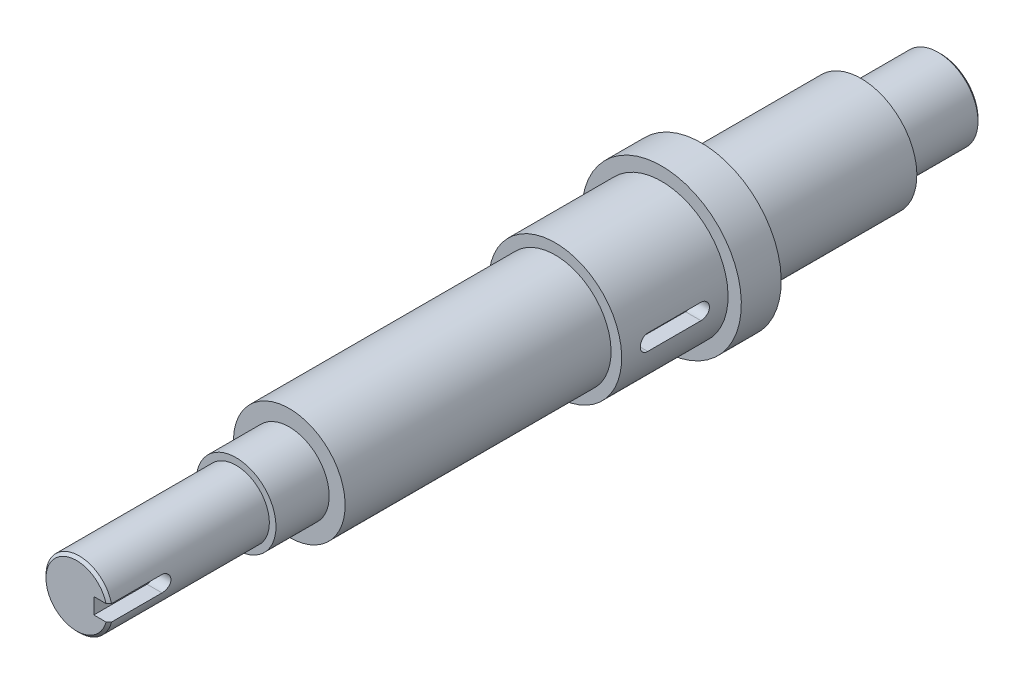
ISO-10303-21;
HEADER;
FILE_DESCRIPTION(('STEP AP214'),'2;1');
FILE_NAME('part.step','',(''),(''),'','','');
FILE_SCHEMA(('AUTOMOTIVE_DESIGN { 1 0 10303 214 1 1 1 1 }'));
ENDSEC;
DATA;
#1=APPLICATION_CONTEXT('core data for automotive mechanical design processes');
#2=APPLICATION_PROTOCOL_DEFINITION('international standard','automotive_design',2000,#1);
#3=PRODUCT_CONTEXT('',#1,'mechanical');
#4=PRODUCT('Part','Part','',(#3));
#5=PRODUCT_RELATED_PRODUCT_CATEGORY('part','',(#4));
#6=PRODUCT_DEFINITION_FORMATION('','',#4);
#7=PRODUCT_DEFINITION_CONTEXT('part definition',#1,'design');
#8=PRODUCT_DEFINITION('design','',#6,#7);
#9=PRODUCT_DEFINITION_SHAPE('','',#8);
#10=(LENGTH_UNIT() NAMED_UNIT(*) SI_UNIT(.MILLI.,.METRE.));
#11=(NAMED_UNIT(*) PLANE_ANGLE_UNIT() SI_UNIT($,.RADIAN.));
#12=(NAMED_UNIT(*) SI_UNIT($,.STERADIAN.) SOLID_ANGLE_UNIT());
#13=UNCERTAINTY_MEASURE_WITH_UNIT(LENGTH_MEASURE(1.E-05),#10,'distance_accuracy_value','');
#14=(GEOMETRIC_REPRESENTATION_CONTEXT(3) GLOBAL_UNCERTAINTY_ASSIGNED_CONTEXT((#13)) GLOBAL_UNIT_ASSIGNED_CONTEXT((#10,
#11,#12)) REPRESENTATION_CONTEXT('',''));
#15=CARTESIAN_POINT('',(0.,0.,0.));
#16=DIRECTION('',(0.,0.,1.));
#17=DIRECTION('',(1.,0.,0.));
#18=AXIS2_PLACEMENT_3D('',#15,#16,#17);
#19=CARTESIAN_POINT('',(0.,12.5,225.));
#20=DIRECTION('',(0.,0.,-1.));
#21=DIRECTION('',(0.,1.,0.));
#22=AXIS2_PLACEMENT_3D('',#19,#20,#21);
#23=PLANE('',#22);
#24=DIRECTION('',(1.,0.,0.));
#25=VECTOR('',#24,1.);
#26=CARTESIAN_POINT('',(6.5,3.,225.));
#27=LINE('',#26,#25);
#28=CARTESIAN_POINT('',(6.5,3.,225.));
#29=VERTEX_POINT('',#28);
#30=CARTESIAN_POINT('',(11.1018016555872,3.,225.));
#31=VERTEX_POINT('',#30);
#32=EDGE_CURVE('E168',#29,#31,#27,.T.);
#33=ORIENTED_EDGE('',*,*,#32,.T.);
#34=CARTESIAN_POINT('',(0.,0.,225.));
#35=DIRECTION('',(0.,0.,-1.));
#36=DIRECTION('',(0.,1.,0.));
#37=AXIS2_PLACEMENT_3D('',#34,#35,#36);
#38=CIRCLE('',#37,11.4999999999999);
#39=CARTESIAN_POINT('',(11.1018016555872,-3.,225.));
#40=VERTEX_POINT('',#39);
#41=EDGE_CURVE('E314',#31,#40,#38,.F.);
#42=ORIENTED_EDGE('',*,*,#41,.T.);
#43=DIRECTION('',(1.,0.,0.));
#44=VECTOR('',#43,1.);
#45=CARTESIAN_POINT('',(6.5,-3.,225.));
#46=LINE('',#45,#44);
#47=CARTESIAN_POINT('',(6.5,-3.,225.));
#48=VERTEX_POINT('',#47);
#49=EDGE_CURVE('E166',#48,#40,#46,.T.);
#50=ORIENTED_EDGE('',*,*,#49,.F.);
#51=DIRECTION('',(0.,-1.,0.));
#52=VECTOR('',#51,1.);
#53=CARTESIAN_POINT('',(6.5,3.,225.));
#54=LINE('',#53,#52);
#55=EDGE_CURVE('E156',#29,#48,#54,.T.);
#56=ORIENTED_EDGE('',*,*,#55,.F.);
#57=EDGE_LOOP('',(#33,#42,#50,#56));
#58=FACE_BOUND('',#57,.T.);
#59=ADVANCED_FACE('F41',(#58),#23,.F.);
#60=CARTESIAN_POINT('',(0.,0.,225.));
#61=DIRECTION('',(0.,0.,1.));
#62=DIRECTION('',(0.,-1.,0.));
#63=AXIS2_PLACEMENT_3D('',#60,#61,#62);
#64=CYLINDRICAL_SURFACE('',#63,12.5);
#65=DIRECTION('',(0.,0.,1.));
#66=VECTOR('',#65,1.);
#67=CARTESIAN_POINT('',(12.1346610995116,-3.,225.));
#68=LINE('',#67,#66);
#69=CARTESIAN_POINT('',(12.1346610995116,-3.,205.));
#70=VERTEX_POINT('',#69);
#71=CARTESIAN_POINT('',(12.1346610995116,-3.,224.));
#72=VERTEX_POINT('',#71);
#73=EDGE_CURVE('E220',#70,#72,#68,.T.);
#74=ORIENTED_EDGE('',*,*,#73,.T.);
#75=CARTESIAN_POINT('',(0.,0.,224.));
#76=DIRECTION('',(0.,0.,-1.));
#77=DIRECTION('',(0.,1.,0.));
#78=AXIS2_PLACEMENT_3D('',#75,#76,#77);
#79=CIRCLE('',#78,12.5);
#80=CARTESIAN_POINT('',(12.1346610995116,3.,224.));
#81=VERTEX_POINT('',#80);
#82=EDGE_CURVE('E56',#72,#81,#79,.T.);
#83=ORIENTED_EDGE('',*,*,#82,.T.);
#84=DIRECTION('',(0.,0.,1.));
#85=VECTOR('',#84,1.);
#86=CARTESIAN_POINT('',(12.1346610995116,3.,225.));
#87=LINE('',#86,#85);
#88=CARTESIAN_POINT('',(12.1346610995116,3.,205.));
#89=VERTEX_POINT('',#88);
#90=EDGE_CURVE('E565',#81,#89,#87,.F.);
#91=ORIENTED_EDGE('',*,*,#90,.T.);
#92=CARTESIAN_POINT('',(12.1346610995116,3.,205.));
#93=CARTESIAN_POINT('',(12.1346522494377,3.00000949206979,204.916922978224));
#94=CARTESIAN_POINT('',(12.1355140524429,2.9965492402964,204.833851503937));
#95=CARTESIAN_POINT('',(12.1389133501175,2.9827629517344,204.668327529238));
#96=CARTESIAN_POINT('',(12.1414505792905,2.97243800275821,204.585874932847));
#97=CARTESIAN_POINT('',(12.1481288815223,2.94502172728164,204.422323492026));
#98=CARTESIAN_POINT('',(12.1522669359733,2.92794313450063,204.341222397578));
#99=CARTESIAN_POINT('',(12.1620165769448,2.88717657683583,204.180811857538));
#100=CARTESIAN_POINT('',(12.1676281805746,2.86348853521017,204.101502432762));
#101=CARTESIAN_POINT('',(12.1864398460761,2.7827647601969,203.86709852316));
#102=CARTESIAN_POINT('',(12.2016236292527,2.71604288181318,203.715371740793));
#103=CARTESIAN_POINT('',(12.2355556800476,2.5588284327867,203.425304451274));
#104=CARTESIAN_POINT('',(12.2543047763988,2.46833033365202,203.286967067702));
#105=CARTESIAN_POINT('',(12.2936784117551,2.26416625581385,203.024742779937));
#106=CARTESIAN_POINT('',(12.3143307958798,2.15010988819482,202.901163433566));
#107=CARTESIAN_POINT('',(12.3549430601195,1.90290471965317,202.67469002816));
#108=CARTESIAN_POINT('',(12.3749028300057,1.76975289686003,202.571799249307));
#109=CARTESIAN_POINT('',(12.4121880567312,1.48603085597283,202.388371734287));
#110=CARTESIAN_POINT('',(12.4294765791586,1.33525974307935,202.308137550489));
#111=CARTESIAN_POINT('',(12.4591517430967,1.02189537698329,202.174270606708));
#112=CARTESIAN_POINT('',(12.4715392966163,0.859304329995022,202.120632896982));
#113=CARTESIAN_POINT('',(12.4898199872169,0.530138997790636,202.042462317637));
#114=CARTESIAN_POINT('',(12.4958303689195,0.363696274008473,202.017403356202));
#115=CARTESIAN_POINT('',(12.5010873641785,0.0288643563729922,201.995452403577));
#116=CARTESIAN_POINT('',(12.5003347508813,-0.139524612787223,201.998557192704));
#117=CARTESIAN_POINT('',(12.4922383469812,-0.469819905954051,202.032463772677));
#118=CARTESIAN_POINT('',(12.4850297856931,-0.631788371671667,202.062697336209));
#119=CARTESIAN_POINT('',(12.464987849248,-0.948281253446577,202.149092233943));
#120=CARTESIAN_POINT('',(12.4521542369652,-1.10280535537953,202.205254661189));
#121=CARTESIAN_POINT('',(12.4220935759201,-1.40155039959009,202.342387659867));
#122=CARTESIAN_POINT('',(12.4048300917434,-1.54567254355723,202.423565148096));
#123=CARTESIAN_POINT('',(12.3677898661535,-1.81844702027331,202.608266219249));
#124=CARTESIAN_POINT('',(12.3480127820245,-1.94709723884516,202.711792850704));
#125=CARTESIAN_POINT('',(12.307525839261,-2.18865245335658,202.941301220019));
#126=CARTESIAN_POINT('',(12.2868050152656,-2.30108617171468,203.067777478397));
#127=CARTESIAN_POINT('',(12.2472145750706,-2.5032746352754,203.338044279781));
#128=CARTESIAN_POINT('',(12.2283454653372,-2.59302318632836,203.481839535922));
#129=CARTESIAN_POINT('',(12.1945549652828,-2.74756993908988,203.783555221143));
#130=CARTESIAN_POINT('',(12.1796525676294,-2.81224875674972,203.941538928879));
#131=CARTESIAN_POINT('',(12.1557369076828,-2.91390343638912,204.266484145526));
#132=CARTESIAN_POINT('',(12.1467148610395,-2.95092063280088,204.43343185786));
#133=CARTESIAN_POINT('',(12.139016121434,-2.98233825509737,204.668168527332));
#134=CARTESIAN_POINT('',(12.1373853406504,-2.98896283223369,204.734406938336));
#135=CARTESIAN_POINT('',(12.1352084107543,-2.9977885892548,204.867086518971));
#136=CARTESIAN_POINT('',(12.1346604885734,-2.99999700022266,204.933527178444));
#137=CARTESIAN_POINT('',(12.1346610995116,-3.,205.));
#138=B_SPLINE_CURVE_WITH_KNOTS('',3,(#92,#93,#94,#95,#96,#97,#98,#99,#100,#101,#102,#103,#104,
#105,#106,#107,#108,#109,#110,#111,#112,#113,#114,#115,#116,#117,#118,#119,#120,#121,#122,#123,
#124,#125,#126,#127,#128,#129,#130,#131,#132,#133,#134,#135,#136,#137),.UNSPECIFIED.,.F.,.F.,(4,
2,2,2,2,2,2,2,2,2,2,2,2,2,2,2,2,2,2,2,2,2,4),(0.,0.24914497147599,0.498250471667307,
0.746888516046017,0.99552944746449,1.49234020490804,1.98926658412719,2.49520478005361,
3.00122312962131,3.51370966397379,4.02610078608322,4.52889907799787,5.03163989067205,
5.52409016416463,6.01656119905144,6.51322041190944,7.00994741434777,7.51903074401432,
8.02825292829705,8.5398711192154,9.05072326792552,9.25036600195107,9.44968157003441),.UNSPECIFIED.);
#139=EDGE_CURVE('E211',#89,#70,#138,.T.);
#140=ORIENTED_EDGE('',*,*,#139,.T.);
#141=EDGE_LOOP('',(#74,#83,#91,#140));
#142=FACE_BOUND('',#141,.T.);
#143=CARTESIAN_POINT('',(0.,0.,165.));
#144=DIRECTION('',(0.,0.,1.));
#145=DIRECTION('',(0.,-1.,0.));
#146=AXIS2_PLACEMENT_3D('',#143,#144,#145);
#147=CIRCLE('',#146,12.5);
#148=CARTESIAN_POINT('',(0.,-12.5,165.));
#149=VERTEX_POINT('',#148);
#150=EDGE_CURVE('E208',#149,#149,#147,.T.);
#151=ORIENTED_EDGE('',*,*,#150,.T.);
#152=EDGE_LOOP('',(#151));
#153=FACE_BOUND('',#152,.T.);
#154=ADVANCED_FACE('F222',(#142,#153),#64,.T.);
#155=CARTESIAN_POINT('',(0.,12.5,165.));
#156=DIRECTION('',(0.,0.,-1.));
#157=DIRECTION('',(0.,1.,0.));
#158=AXIS2_PLACEMENT_3D('',#155,#156,#157);
#159=PLANE('',#158);
#160=ORIENTED_EDGE('',*,*,#150,.F.);
#161=EDGE_LOOP('',(#160));
#162=FACE_BOUND('',#161,.T.);
#163=CARTESIAN_POINT('',(0.,0.,165.));
#164=DIRECTION('',(0.,0.,1.));
#165=DIRECTION('',(0.,-1.,0.));
#166=AXIS2_PLACEMENT_3D('',#163,#164,#165);
#167=CIRCLE('',#166,15.);
#168=CARTESIAN_POINT('',(0.,-15.,165.));
#169=VERTEX_POINT('',#168);
#170=EDGE_CURVE('E205',#169,#169,#167,.T.);
#171=ORIENTED_EDGE('',*,*,#170,.T.);
#172=EDGE_LOOP('',(#171));
#173=FACE_BOUND('',#172,.T.);
#174=ADVANCED_FACE('F353',(#162,#173),#159,.F.);
#175=CARTESIAN_POINT('',(0.,0.,225.));
#176=DIRECTION('',(0.,0.,1.));
#177=DIRECTION('',(0.,-1.,0.));
#178=AXIS2_PLACEMENT_3D('',#175,#176,#177);
#179=CYLINDRICAL_SURFACE('',#178,15.);
#180=ORIENTED_EDGE('',*,*,#170,.F.);
#181=EDGE_LOOP('',(#180));
#182=FACE_BOUND('',#181,.T.);
#183=CARTESIAN_POINT('',(0.,0.,145.));
#184=DIRECTION('',(0.,0.,1.));
#185=DIRECTION('',(0.,-1.,0.));
#186=AXIS2_PLACEMENT_3D('',#183,#184,#185);
#187=CIRCLE('',#186,15.);
#188=CARTESIAN_POINT('',(0.,-15.,145.));
#189=VERTEX_POINT('',#188);
#190=EDGE_CURVE('E202',#189,#189,#187,.T.);
#191=ORIENTED_EDGE('',*,*,#190,.T.);
#192=EDGE_LOOP('',(#191));
#193=FACE_BOUND('',#192,.T.);
#194=ADVANCED_FACE('F484',(#182,#193),#179,.T.);
#195=CARTESIAN_POINT('',(0.,15.,145.));
#196=DIRECTION('',(0.,0.,-1.));
#197=DIRECTION('',(0.,1.,0.));
#198=AXIS2_PLACEMENT_3D('',#195,#196,#197);
#199=PLANE('',#198);
#200=ORIENTED_EDGE('',*,*,#190,.F.);
#201=EDGE_LOOP('',(#200));
#202=FACE_BOUND('',#201,.T.);
#203=CARTESIAN_POINT('',(0.,0.,145.));
#204=DIRECTION('',(0.,0.,1.));
#205=DIRECTION('',(0.,-1.,0.));
#206=AXIS2_PLACEMENT_3D('',#203,#204,#205);
#207=CIRCLE('',#206,21.);
#208=CARTESIAN_POINT('',(0.,-21.,145.));
#209=VERTEX_POINT('',#208);
#210=EDGE_CURVE('E199',#209,#209,#207,.T.);
#211=ORIENTED_EDGE('',*,*,#210,.T.);
#212=EDGE_LOOP('',(#211));
#213=FACE_BOUND('',#212,.T.);
#214=ADVANCED_FACE('F475',(#202,#213),#199,.F.);
#215=CARTESIAN_POINT('',(0.,0.,225.));
#216=DIRECTION('',(0.,0.,1.));
#217=DIRECTION('',(0.,-1.,0.));
#218=AXIS2_PLACEMENT_3D('',#215,#216,#217);
#219=CYLINDRICAL_SURFACE('',#218,21.);
#220=ORIENTED_EDGE('',*,*,#210,.F.);
#221=EDGE_LOOP('',(#220));
#222=FACE_BOUND('',#221,.T.);
#223=CARTESIAN_POINT('',(0.,0.,45.));
#224=DIRECTION('',(0.,0.,1.));
#225=DIRECTION('',(0.,-1.,0.));
#226=AXIS2_PLACEMENT_3D('',#223,#224,#225);
#227=CIRCLE('',#226,21.);
#228=CARTESIAN_POINT('',(0.,-21.,45.));
#229=VERTEX_POINT('',#228);
#230=EDGE_CURVE('E196',#229,#229,#227,.T.);
#231=ORIENTED_EDGE('',*,*,#230,.T.);
#232=EDGE_LOOP('',(#231));
#233=FACE_BOUND('',#232,.T.);
#234=ADVANCED_FACE('F466',(#222,#233),#219,.T.);
#235=CARTESIAN_POINT('',(0.,21.,45.));
#236=DIRECTION('',(0.,0.,-1.));
#237=DIRECTION('',(0.,1.,0.));
#238=AXIS2_PLACEMENT_3D('',#235,#236,#237);
#239=PLANE('',#238);
#240=ORIENTED_EDGE('',*,*,#230,.F.);
#241=EDGE_LOOP('',(#240));
#242=FACE_BOUND('',#241,.T.);
#243=CARTESIAN_POINT('',(0.,0.,45.));
#244=DIRECTION('',(0.,0.,1.));
#245=DIRECTION('',(0.,-1.,0.));
#246=AXIS2_PLACEMENT_3D('',#243,#244,#245);
#247=CIRCLE('',#246,25.);
#248=CARTESIAN_POINT('',(0.,-25.,45.));
#249=VERTEX_POINT('',#248);
#250=EDGE_CURVE('E193',#249,#249,#247,.T.);
#251=ORIENTED_EDGE('',*,*,#250,.T.);
#252=EDGE_LOOP('',(#251));
#253=FACE_BOUND('',#252,.T.);
#254=ADVANCED_FACE('F276',(#242,#253),#239,.F.);
#255=CARTESIAN_POINT('',(0.,0.,225.));
#256=DIRECTION('',(0.,0.,1.));
#257=DIRECTION('',(0.,-1.,0.));
#258=AXIS2_PLACEMENT_3D('',#255,#256,#257);
#259=CYLINDRICAL_SURFACE('',#258,25.);
#260=DIRECTION('',(0.,0.,1.));
#261=VECTOR('',#260,1.);
#262=CARTESIAN_POINT('',(24.8193472919817,3.,225.));
#263=LINE('',#262,#261);
#264=CARTESIAN_POINT('',(24.8193472919817,3.,35.));
#265=VERTEX_POINT('',#264);
#266=CARTESIAN_POINT('',(24.8193472919817,3.,15.));
#267=VERTEX_POINT('',#266);
#268=EDGE_CURVE('E361',#265,#267,#263,.F.);
#269=ORIENTED_EDGE('',*,*,#268,.T.);
#270=CARTESIAN_POINT('',(24.8193472919817,3.,15.));
#271=CARTESIAN_POINT('',(24.8193430736193,3.00000843700235,14.9159454294658));
#272=CARTESIAN_POINT('',(24.8197741982077,2.99646747025333,14.8318951068114));
#273=CARTESIAN_POINT('',(24.8214759555701,2.98235207723993,14.6644017857417));
#274=CARTESIAN_POINT('',(24.8227465256294,2.97177817640363,14.5809587424276));
#275=CARTESIAN_POINT('',(24.8260943334576,2.94367627524767,14.4153487561558));
#276=CARTESIAN_POINT('',(24.8281707648871,2.92615522582029,14.3331806227325));
#277=CARTESIAN_POINT('',(24.833067059444,2.88430583660214,14.1706435046024));
#278=CARTESIAN_POINT('',(24.8358869177826,2.85997754065988,14.0902745083102));
#279=CARTESIAN_POINT('',(24.8453506394644,2.77699495332482,13.8526614373121));
#280=CARTESIAN_POINT('',(24.8530006371154,2.70832727734934,13.6988194165884));
#281=CARTESIAN_POINT('',(24.8701147720304,2.54636529375022,13.4049406113502));
#282=CARTESIAN_POINT('',(24.8795787509723,2.45307313505292,13.2649026236508));
#283=CARTESIAN_POINT('',(24.8993093935248,2.24397860633709,13.0017737438303));
#284=CARTESIAN_POINT('',(24.9095794895088,2.12807646891959,12.8787622524539));
#285=CARTESIAN_POINT('',(24.929735159082,1.87725939084289,12.6538800661769));
#286=CARTESIAN_POINT('',(24.9396206738931,1.74234155834833,12.552012592616));
#287=CARTESIAN_POINT('',(24.9579276686417,1.45682542703621,12.372031257657));
#288=CARTESIAN_POINT('',(24.9663446368759,1.30618100217361,12.2939900637665));
#289=CARTESIAN_POINT('',(24.9807274830984,0.993816096927466,12.1643483312082));
#290=CARTESIAN_POINT('',(24.9866935907597,0.832096656054214,12.1127453148765));
#291=CARTESIAN_POINT('',(24.995478678279,0.502989868574012,12.0376782357157));
#292=CARTESIAN_POINT('',(24.9983126679218,0.335633549841866,12.0140799277622));
#293=CARTESIAN_POINT('',(25.0005654502745,-0.000690387403205051,11.9952762772877));
#294=CARTESIAN_POINT('',(24.9999842845517,-0.169657986279601,12.0000705891887));
#295=CARTESIAN_POINT('',(24.9954842865412,-0.503486116101075,12.0378091713517));
#296=CARTESIAN_POINT('',(24.9915826671991,-0.668363323052681,12.070608270074));
#297=CARTESIAN_POINT('',(24.9808996061534,-0.990255211381979,12.1631984833145));
#298=CARTESIAN_POINT('',(24.9741181287549,-1.14726979527835,12.2229899323936));
#299=CARTESIAN_POINT('',(24.9584076216555,-1.44943435784417,12.3680242361996));
#300=CARTESIAN_POINT('',(24.9494732343632,-1.59455350752095,12.4533307157787));
#301=CARTESIAN_POINT('',(24.930457665413,-1.86846446131942,12.646923724757));
#302=CARTESIAN_POINT('',(24.9203764842939,-1.99725627311207,12.7552102433596));
#303=CARTESIAN_POINT('',(24.9001221731951,-2.23569948521557,12.9924860710071));
#304=CARTESIAN_POINT('',(24.8899488597477,-2.34522783687393,13.1215990400248));
#305=CARTESIAN_POINT('',(24.8707153122042,-2.54111038184353,13.3964907357138));
#306=CARTESIAN_POINT('',(24.8616554109923,-2.62745765364829,13.5422744215129));
#307=CARTESIAN_POINT('',(24.8456732661311,-2.77453048342125,13.8464951727214));
#308=CARTESIAN_POINT('',(24.8387530810146,-2.83523138851723,14.0049442397206));
#309=CARTESIAN_POINT('',(24.8278671834514,-2.92904058504843,14.3297723502964));
#310=CARTESIAN_POINT('',(24.8238970186796,-2.96219046692828,14.4961390386934));
#311=CARTESIAN_POINT('',(24.8208658563087,-2.98741264811551,14.7197465098321));
#312=CARTESIAN_POINT('',(24.8202967895628,-2.9921351676027,14.7757413064748));
#313=CARTESIAN_POINT('',(24.8195379557837,-2.9984246127832,14.8878161899351));
#314=CARTESIAN_POINT('',(24.8193475536301,-2.99999682241004,14.9438959757855));
#315=CARTESIAN_POINT('',(24.8193472919817,-3.,15.));
#316=B_SPLINE_CURVE_WITH_KNOTS('',3,(#270,#271,#272,#273,#274,#275,#276,#277,#278,#279,#280,
#281,#282,#283,#284,#285,#286,#287,#288,#289,#290,#291,#292,#293,#294,#295,#296,#297,#298,#299,
#300,#301,#302,#303,#304,#305,#306,#307,#308,#309,#310,#311,#312,#313,#314,#315),.UNSPECIFIED.,
.F.,.F.,(4,2,2,2,2,2,2,2,2,2,2,2,2,2,2,2,2,2,2,2,2,2,4),(0.,0.252080487248508,0.504142143765639,
0.755952236629468,1.00776070750916,1.51110152671864,2.01439843495776,2.51996855511054,
3.02561564359015,3.53278983870558,4.03991649509849,4.5446022091959,5.04928178057386,
5.55136096184882,6.05344636639431,6.55679437122678,7.0601421395737,7.56659676194983,
8.07320243596132,8.58029398875541,9.08661864921346,9.25514284244892,9.42338413699563),.UNSPECIFIED.);
#317=CARTESIAN_POINT('',(24.8193472919817,-3.,15.));
#318=VERTEX_POINT('',#317);
#319=EDGE_CURVE('E281',#267,#318,#316,.T.);
#320=ORIENTED_EDGE('',*,*,#319,.T.);
#321=DIRECTION('',(0.,0.,1.));
#322=VECTOR('',#321,1.);
#323=CARTESIAN_POINT('',(24.8193472919817,-3.,225.));
#324=LINE('',#323,#322);
#325=CARTESIAN_POINT('',(24.8193472919817,-2.99999999999998,35.));
#326=VERTEX_POINT('',#325);
#327=EDGE_CURVE('E294',#318,#326,#324,.T.);
#328=ORIENTED_EDGE('',*,*,#327,.T.);
#329=CARTESIAN_POINT('',(24.8193472919817,-3.,35.));
#330=CARTESIAN_POINT('',(24.8193430736193,-3.00000843700235,35.0840545705342));
#331=CARTESIAN_POINT('',(24.8197741982077,-2.99646747025333,35.1681048931886));
#332=CARTESIAN_POINT('',(24.8214759555701,-2.98235207723993,35.3355982142582));
#333=CARTESIAN_POINT('',(24.8227465256294,-2.97177817640363,35.4190412575723));
#334=CARTESIAN_POINT('',(24.8260943334576,-2.94367627524767,35.5846512438442));
#335=CARTESIAN_POINT('',(24.8281707648871,-2.92615522582029,35.6668193772675));
#336=CARTESIAN_POINT('',(24.833067059444,-2.88430583660214,35.8293564953975));
#337=CARTESIAN_POINT('',(24.8358869177826,-2.85997754065988,35.9097254916897));
#338=CARTESIAN_POINT('',(24.8453506394644,-2.77699495332482,36.1473385626879));
#339=CARTESIAN_POINT('',(24.8530006371154,-2.70832727734934,36.3011805834115));
#340=CARTESIAN_POINT('',(24.8701147720304,-2.54636529375022,36.5950593886498));
#341=CARTESIAN_POINT('',(24.8795787509723,-2.45307313505291,36.7350973763491));
#342=CARTESIAN_POINT('',(24.8993093935248,-2.24397860633708,36.9982262561697));
#343=CARTESIAN_POINT('',(24.9095794895088,-2.12807646891959,37.121237747546));
#344=CARTESIAN_POINT('',(24.929735159082,-1.87725939084289,37.3461199338231));
#345=CARTESIAN_POINT('',(24.9396206738931,-1.74234155834833,37.447987407384));
#346=CARTESIAN_POINT('',(24.9579276686417,-1.45682542703621,37.6279687423429));
#347=CARTESIAN_POINT('',(24.9663446368759,-1.30618100217361,37.7060099362334));
#348=CARTESIAN_POINT('',(24.9807274830984,-0.993816096927468,37.8356516687917));
#349=CARTESIAN_POINT('',(24.9866935907597,-0.832096656054216,37.8872546851235));
#350=CARTESIAN_POINT('',(24.995478678279,-0.502989868574014,37.9623217642842));
#351=CARTESIAN_POINT('',(24.9983126679218,-0.335633549841867,37.9859200722377));
#352=CARTESIAN_POINT('',(25.0005654502745,0.000690387403203262,38.0047237227123));
#353=CARTESIAN_POINT('',(24.9999842845517,0.169657986279599,37.9999294108113));
#354=CARTESIAN_POINT('',(24.9954842865412,0.503486116101073,37.9621908286482));
#355=CARTESIAN_POINT('',(24.9915826671991,0.66836332305268,37.929391729926));
#356=CARTESIAN_POINT('',(24.9808996061534,0.990255211381977,37.8368015166855));
#357=CARTESIAN_POINT('',(24.9741181287549,1.14726979527835,37.7770100676064));
#358=CARTESIAN_POINT('',(24.9584076216555,1.44943435784417,37.6319757638004));
#359=CARTESIAN_POINT('',(24.9494732343632,1.59455350752095,37.5466692842213));
#360=CARTESIAN_POINT('',(24.930457665413,1.86846446131942,37.353076275243));
#361=CARTESIAN_POINT('',(24.9203764842939,1.99725627311207,37.2447897566403));
#362=CARTESIAN_POINT('',(24.9001221731951,2.23569948521557,37.0075139289929));
#363=CARTESIAN_POINT('',(24.8899488597477,2.34522783687393,36.8784009599752));
#364=CARTESIAN_POINT('',(24.8707153122042,2.54111038184353,36.6035092642862));
#365=CARTESIAN_POINT('',(24.8616554109923,2.62745765364829,36.457725578487));
#366=CARTESIAN_POINT('',(24.8456732661311,2.77453048342125,36.1535048272786));
#367=CARTESIAN_POINT('',(24.8387530810146,2.83523138851723,35.9950557602794));
#368=CARTESIAN_POINT('',(24.8278671834514,2.92904058504843,35.6702276497036));
#369=CARTESIAN_POINT('',(24.8238970186796,2.96219046692828,35.5038609613065));
#370=CARTESIAN_POINT('',(24.8208658563087,2.98741264811551,35.2802534901679));
#371=CARTESIAN_POINT('',(24.8202967895628,2.9921351676027,35.2242586935252));
#372=CARTESIAN_POINT('',(24.8195379557837,2.9984246127832,35.1121838100649));
#373=CARTESIAN_POINT('',(24.8193475536301,2.99999682241004,35.0561040242145));
#374=CARTESIAN_POINT('',(24.8193472919817,3.,35.));
#375=B_SPLINE_CURVE_WITH_KNOTS('',3,(#329,#330,#331,#332,#333,#334,#335,#336,#337,#338,#339,
#340,#341,#342,#343,#344,#345,#346,#347,#348,#349,#350,#351,#352,#353,#354,#355,#356,#357,#358,
#359,#360,#361,#362,#363,#364,#365,#366,#367,#368,#369,#370,#371,#372,#373,#374),.UNSPECIFIED.,
.F.,.F.,(4,2,2,2,2,2,2,2,2,2,2,2,2,2,2,2,2,2,2,2,2,2,4),(0.,0.252080487248506,0.504142143765639,
0.755952236629464,1.00776070750916,1.51110152671864,2.01439843495776,2.51996855511055,
3.02561564359015,3.53278983870558,4.03991649509848,4.54460220919589,5.04928178057386,
5.55136096184882,6.05344636639431,6.55679437122678,7.0601421395737,7.56659676194982,
8.07320243596131,8.5802939887554,9.08661864921347,9.25514284244891,9.42338413699563),.UNSPECIFIED.);
#376=EDGE_CURVE('E123',#326,#265,#375,.T.);
#377=ORIENTED_EDGE('',*,*,#376,.T.);
#378=EDGE_LOOP('',(#269,#320,#328,#377));
#379=FACE_BOUND('',#378,.T.);
#380=ORIENTED_EDGE('',*,*,#250,.F.);
#381=EDGE_LOOP('',(#380));
#382=FACE_BOUND('',#381,.T.);
#383=CARTESIAN_POINT('',(0.,0.,4.99999999999998));
#384=DIRECTION('',(0.,0.,1.));
#385=DIRECTION('',(0.,-1.,0.));
#386=AXIS2_PLACEMENT_3D('',#383,#384,#385);
#387=CIRCLE('',#386,25.);
#388=CARTESIAN_POINT('',(0.,-25.,4.99999999999998));
#389=VERTEX_POINT('',#388);
#390=EDGE_CURVE('E190',#389,#389,#387,.T.);
#391=ORIENTED_EDGE('',*,*,#390,.T.);
#392=EDGE_LOOP('',(#391));
#393=FACE_BOUND('',#392,.T.);
#394=ADVANCED_FACE('F271',(#379,#382,#393),#259,.T.);
#395=CARTESIAN_POINT('',(0.,25.,4.99999999999999));
#396=DIRECTION('',(0.,0.,-1.));
#397=DIRECTION('',(0.,1.,0.));
#398=AXIS2_PLACEMENT_3D('',#395,#396,#397);
#399=PLANE('',#398);
#400=ORIENTED_EDGE('',*,*,#390,.F.);
#401=EDGE_LOOP('',(#400));
#402=FACE_BOUND('',#401,.T.);
#403=CARTESIAN_POINT('',(0.,0.,5.));
#404=DIRECTION('',(0.,0.,1.));
#405=DIRECTION('',(0.,-1.,0.));
#406=AXIS2_PLACEMENT_3D('',#403,#404,#405);
#407=CIRCLE('',#406,30.);
#408=CARTESIAN_POINT('',(0.,-30.,5.));
#409=VERTEX_POINT('',#408);
#410=EDGE_CURVE('E187',#409,#409,#407,.T.);
#411=ORIENTED_EDGE('',*,*,#410,.T.);
#412=EDGE_LOOP('',(#411));
#413=FACE_BOUND('',#412,.T.);
#414=ADVANCED_FACE('F267',(#402,#413),#399,.F.);
#415=CARTESIAN_POINT('',(0.,0.,225.));
#416=DIRECTION('',(0.,0.,1.));
#417=DIRECTION('',(0.,-1.,0.));
#418=AXIS2_PLACEMENT_3D('',#415,#416,#417);
#419=CYLINDRICAL_SURFACE('',#418,30.);
#420=ORIENTED_EDGE('',*,*,#410,.F.);
#421=EDGE_LOOP('',(#420));
#422=FACE_BOUND('',#421,.T.);
#423=CARTESIAN_POINT('',(0.,0.,-10.));
#424=DIRECTION('',(0.,0.,1.));
#425=DIRECTION('',(0.,-1.,0.));
#426=AXIS2_PLACEMENT_3D('',#423,#424,#425);
#427=CIRCLE('',#426,30.);
#428=CARTESIAN_POINT('',(0.,-30.,-10.));
#429=VERTEX_POINT('',#428);
#430=EDGE_CURVE('E184',#429,#429,#427,.T.);
#431=ORIENTED_EDGE('',*,*,#430,.T.);
#432=EDGE_LOOP('',(#431));
#433=FACE_BOUND('',#432,.T.);
#434=ADVANCED_FACE('F263',(#422,#433),#419,.T.);
#435=CARTESIAN_POINT('',(0.,30.,-10.));
#436=DIRECTION('',(0.,0.,1.));
#437=DIRECTION('',(0.,-1.,0.));
#438=AXIS2_PLACEMENT_3D('',#435,#436,#437);
#439=PLANE('',#438);
#440=ORIENTED_EDGE('',*,*,#430,.F.);
#441=EDGE_LOOP('',(#440));
#442=FACE_BOUND('',#441,.T.);
#443=CARTESIAN_POINT('',(0.,0.,-10.));
#444=DIRECTION('',(0.,0.,1.));
#445=DIRECTION('',(0.,-1.,0.));
#446=AXIS2_PLACEMENT_3D('',#443,#444,#445);
#447=CIRCLE('',#446,21.);
#448=CARTESIAN_POINT('',(0.,-21.,-10.));
#449=VERTEX_POINT('',#448);
#450=EDGE_CURVE('E181',#449,#449,#447,.T.);
#451=ORIENTED_EDGE('',*,*,#450,.T.);
#452=EDGE_LOOP('',(#451));
#453=FACE_BOUND('',#452,.T.);
#454=ADVANCED_FACE('F259',(#442,#453),#439,.F.);
#455=CARTESIAN_POINT('',(0.,0.,225.));
#456=DIRECTION('',(0.,0.,1.));
#457=DIRECTION('',(0.,-1.,0.));
#458=AXIS2_PLACEMENT_3D('',#455,#456,#457);
#459=CYLINDRICAL_SURFACE('',#458,21.);
#460=ORIENTED_EDGE('',*,*,#450,.F.);
#461=EDGE_LOOP('',(#460));
#462=FACE_BOUND('',#461,.T.);
#463=CARTESIAN_POINT('',(0.,0.,-70.));
#464=DIRECTION('',(0.,0.,1.));
#465=DIRECTION('',(0.,-1.,0.));
#466=AXIS2_PLACEMENT_3D('',#463,#464,#465);
#467=CIRCLE('',#466,21.);
#468=CARTESIAN_POINT('',(0.,-21.,-70.));
#469=VERTEX_POINT('',#468);
#470=EDGE_CURVE('E178',#469,#469,#467,.T.);
#471=ORIENTED_EDGE('',*,*,#470,.T.);
#472=EDGE_LOOP('',(#471));
#473=FACE_BOUND('',#472,.T.);
#474=ADVANCED_FACE('F255',(#462,#473),#459,.T.);
#475=CARTESIAN_POINT('',(0.,21.,-70.));
#476=DIRECTION('',(0.,0.,1.));
#477=DIRECTION('',(0.,-1.,0.));
#478=AXIS2_PLACEMENT_3D('',#475,#476,#477);
#479=PLANE('',#478);
#480=CARTESIAN_POINT('',(0.,0.,-70.));
#481=DIRECTION('',(0.,0.,1.));
#482=DIRECTION('',(0.,-1.,0.));
#483=AXIS2_PLACEMENT_3D('',#480,#481,#482);
#484=CIRCLE('',#483,16.);
#485=CARTESIAN_POINT('',(0.,-16.,-70.));
#486=VERTEX_POINT('',#485);
#487=EDGE_CURVE('E49',#486,#486,#484,.T.);
#488=ORIENTED_EDGE('',*,*,#487,.T.);
#489=EDGE_LOOP('',(#488));
#490=FACE_BOUND('',#489,.T.);
#491=ORIENTED_EDGE('',*,*,#470,.F.);
#492=EDGE_LOOP('',(#491));
#493=FACE_BOUND('',#492,.T.);
#494=ADVANCED_FACE('F251',(#490,#493),#479,.F.);
#495=CARTESIAN_POINT('',(0.,0.,225.));
#496=DIRECTION('',(0.,0.,1.));
#497=DIRECTION('',(0.,-1.,0.));
#498=AXIS2_PLACEMENT_3D('',#495,#496,#497);
#499=CYLINDRICAL_SURFACE('',#498,15.);
#500=CARTESIAN_POINT('',(0.,0.,-71.));
#501=DIRECTION('',(0.,0.,1.));
#502=DIRECTION('',(0.,-1.,0.));
#503=AXIS2_PLACEMENT_3D('',#500,#501,#502);
#504=CIRCLE('',#503,15.);
#505=CARTESIAN_POINT('',(0.,-15.,-71.));
#506=VERTEX_POINT('',#505);
#507=EDGE_CURVE('E11',#506,#506,#504,.F.);
#508=ORIENTED_EDGE('',*,*,#507,.T.);
#509=EDGE_LOOP('',(#508));
#510=FACE_BOUND('',#509,.T.);
#511=CARTESIAN_POINT('',(0.,0.,-99.));
#512=DIRECTION('',(0.,0.,1.));
#513=DIRECTION('',(0.,-1.,0.));
#514=AXIS2_PLACEMENT_3D('',#511,#512,#513);
#515=CIRCLE('',#514,15.);
#516=CARTESIAN_POINT('',(0.,-15.,-99.));
#517=VERTEX_POINT('',#516);
#518=EDGE_CURVE('E332',#517,#517,#515,.T.);
#519=ORIENTED_EDGE('',*,*,#518,.T.);
#520=EDGE_LOOP('',(#519));
#521=FACE_BOUND('',#520,.T.);
#522=ADVANCED_FACE('F247',(#510,#521),#499,.T.);
#523=CARTESIAN_POINT('',(0.,15.,-100.));
#524=DIRECTION('',(0.,0.,1.));
#525=DIRECTION('',(0.,-1.,0.));
#526=AXIS2_PLACEMENT_3D('',#523,#524,#525);
#527=PLANE('',#526);
#528=CARTESIAN_POINT('',(0.,0.,-100.));
#529=DIRECTION('',(0.,0.,1.));
#530=DIRECTION('',(0.,-1.,0.));
#531=AXIS2_PLACEMENT_3D('',#528,#529,#530);
#532=CIRCLE('',#531,14.);
#533=CARTESIAN_POINT('',(0.,-14.,-100.));
#534=VERTEX_POINT('',#533);
#535=EDGE_CURVE('E335',#534,#534,#532,.F.);
#536=ORIENTED_EDGE('',*,*,#535,.T.);
#537=EDGE_LOOP('',(#536));
#538=FACE_BOUND('',#537,.T.);
#539=CARTESIAN_POINT('',(0.,0.,-100.));
#540=DIRECTION('',(0.,0.,-1.));
#541=DIRECTION('',(0.,1.,0.));
#542=AXIS2_PLACEMENT_3D('',#539,#540,#541);
#543=CIRCLE('',#542,3.5);
#544=CARTESIAN_POINT('',(0.,3.5,-100.));
#545=VERTEX_POINT('',#544);
#546=EDGE_CURVE('E165',#545,#545,#543,.T.);
#547=ORIENTED_EDGE('',*,*,#546,.F.);
#548=EDGE_LOOP('',(#547));
#549=FACE_BOUND('',#548,.T.);
#550=ADVANCED_FACE('F243',(#538,#549),#527,.F.);
#551=CARTESIAN_POINT('',(0.,0.,-81.));
#552=DIRECTION('',(0.,0.,-1.));
#553=DIRECTION('',(0.,1.,0.));
#554=AXIS2_PLACEMENT_3D('',#551,#552,#553);
#555=CONICAL_SURFACE('',#554,3.5,1.02974425867665);
#556=CARTESIAN_POINT('',(0.,0.,-78.8969878334035));
#557=VERTEX_POINT('',#556);
#558=VERTEX_LOOP('',#557);
#559=FACE_BOUND('',#558,.T.);
#560=CARTESIAN_POINT('',(0.,0.,-81.));
#561=DIRECTION('',(0.,0.,-1.));
#562=DIRECTION('',(0.,1.,0.));
#563=AXIS2_PLACEMENT_3D('',#560,#561,#562);
#564=CIRCLE('',#563,3.5);
#565=CARTESIAN_POINT('',(0.,3.49999999999999,-81.));
#566=VERTEX_POINT('',#565);
#567=EDGE_CURVE('E175',#566,#566,#564,.T.);
#568=ORIENTED_EDGE('',*,*,#567,.T.);
#569=EDGE_LOOP('',(#568));
#570=FACE_BOUND('',#569,.T.);
#571=ADVANCED_FACE('F239',(#559,#570),#555,.F.);
#572=CARTESIAN_POINT('',(0.,0.,-100.));
#573=DIRECTION('',(0.,0.,-1.));
#574=DIRECTION('',(0.,1.,0.));
#575=AXIS2_PLACEMENT_3D('',#572,#573,#574);
#576=CYLINDRICAL_SURFACE('',#575,3.5);
#577=ORIENTED_EDGE('',*,*,#567,.F.);
#578=EDGE_LOOP('',(#577));
#579=FACE_BOUND('',#578,.T.);
#580=ORIENTED_EDGE('',*,*,#546,.T.);
#581=EDGE_LOOP('',(#580));
#582=FACE_BOUND('',#581,.T.);
#583=ADVANCED_FACE('F232',(#579,#582),#576,.F.);
#584=CARTESIAN_POINT('',(6.5,0.,205.));
#585=DIRECTION('',(1.,0.,0.));
#586=DIRECTION('',(0.,0.,-1.));
#587=AXIS2_PLACEMENT_3D('',#584,#585,#586);
#588=CYLINDRICAL_SURFACE('',#587,3.);
#589=DIRECTION('',(1.,0.,0.));
#590=VECTOR('',#589,1.);
#591=CARTESIAN_POINT('',(6.5,3.,205.));
#592=LINE('',#591,#590);
#593=CARTESIAN_POINT('',(6.5,3.,205.));
#594=VERTEX_POINT('',#593);
#595=EDGE_CURVE('E161',#594,#89,#592,.T.);
#596=ORIENTED_EDGE('',*,*,#595,.F.);
#597=CARTESIAN_POINT('',(6.5,0.,205.));
#598=DIRECTION('',(1.,0.,0.));
#599=DIRECTION('',(0.,0.,-1.));
#600=AXIS2_PLACEMENT_3D('',#597,#598,#599);
#601=CIRCLE('',#600,3.);
#602=CARTESIAN_POINT('',(6.5,-3.,205.));
#603=VERTEX_POINT('',#602);
#604=EDGE_CURVE('E146',#603,#594,#601,.T.);
#605=ORIENTED_EDGE('',*,*,#604,.F.);
#606=DIRECTION('',(1.,0.,0.));
#607=VECTOR('',#606,1.);
#608=CARTESIAN_POINT('',(6.5,-3.,205.));
#609=LINE('',#608,#607);
#610=EDGE_CURVE('E162',#603,#70,#609,.T.);
#611=ORIENTED_EDGE('',*,*,#610,.T.);
#612=ORIENTED_EDGE('',*,*,#139,.F.);
#613=EDGE_LOOP('',(#596,#605,#611,#612));
#614=FACE_BOUND('',#613,.T.);
#615=ADVANCED_FACE('F226',(#614),#588,.F.);
#616=CARTESIAN_POINT('',(6.5,-3.,205.));
#617=DIRECTION('',(0.,-1.,0.));
#618=DIRECTION('',(0.,0.,-1.));
#619=AXIS2_PLACEMENT_3D('',#616,#617,#618);
#620=PLANE('',#619);
#621=ORIENTED_EDGE('',*,*,#49,.T.);
#622=CARTESIAN_POINT('',(11.1018016555872,-3.,225.));
#623=CARTESIAN_POINT('',(11.2741767184521,-3.,224.833572766151));
#624=CARTESIAN_POINT('',(11.4464358719439,-3.,224.667025814211));
#625=CARTESIAN_POINT('',(11.7907223532427,-3.,224.333692480868));
#626=CARTESIAN_POINT('',(11.962749681059,-3.,224.166906099475));
#627=CARTESIAN_POINT('',(12.1346610995116,-3.,224.));
#628=B_SPLINE_CURVE_WITH_KNOTS('',3,(#622,#623,#624,#625,#626,#627),.UNSPECIFIED.,.F.,.F.,(4,2,
4),(0.,0.718818425236404,1.4376368214992),.UNSPECIFIED.);
#629=EDGE_CURVE('E64',#40,#72,#628,.T.);
#630=ORIENTED_EDGE('',*,*,#629,.T.);
#631=ORIENTED_EDGE('',*,*,#73,.F.);
#632=ORIENTED_EDGE('',*,*,#610,.F.);
#633=DIRECTION('',(0.,0.,-1.));
#634=VECTOR('',#633,1.);
#635=CARTESIAN_POINT('',(6.5,-3.,205.));
#636=LINE('',#635,#634);
#637=EDGE_CURVE('E158',#48,#603,#636,.T.);
#638=ORIENTED_EDGE('',*,*,#637,.F.);
#639=EDGE_LOOP('',(#621,#630,#631,#632,#638));
#640=FACE_BOUND('',#639,.T.);
#641=ADVANCED_FACE('F231',(#640),#620,.F.);
#642=CARTESIAN_POINT('',(6.5,3.,205.));
#643=DIRECTION('',(0.,1.,0.));
#644=DIRECTION('',(0.,0.,1.));
#645=AXIS2_PLACEMENT_3D('',#642,#643,#644);
#646=PLANE('',#645);
#647=ORIENTED_EDGE('',*,*,#90,.F.);
#648=CARTESIAN_POINT('',(12.1346610995116,3.,224.));
#649=CARTESIAN_POINT('',(11.962749681059,3.,224.166906099475));
#650=CARTESIAN_POINT('',(11.7907223532427,3.,224.333692480868));
#651=CARTESIAN_POINT('',(11.4464358719439,3.,224.667025814211));
#652=CARTESIAN_POINT('',(11.2741767184521,3.,224.833572766151));
#653=CARTESIAN_POINT('',(11.1018016555872,3.,225.));
#654=B_SPLINE_CURVE_WITH_KNOTS('',3,(#648,#649,#650,#651,#652,#653),.UNSPECIFIED.,.F.,.F.,(4,2,
4),(0.,0.718818396262786,1.43763682149921),.UNSPECIFIED.);
#655=EDGE_CURVE('E326',#81,#31,#654,.T.);
#656=ORIENTED_EDGE('',*,*,#655,.T.);
#657=ORIENTED_EDGE('',*,*,#32,.F.);
#658=DIRECTION('',(0.,0.,1.));
#659=VECTOR('',#658,1.);
#660=CARTESIAN_POINT('',(6.5,3.,205.));
#661=LINE('',#660,#659);
#662=EDGE_CURVE('E153',#594,#29,#661,.T.);
#663=ORIENTED_EDGE('',*,*,#662,.F.);
#664=ORIENTED_EDGE('',*,*,#595,.T.);
#665=EDGE_LOOP('',(#647,#656,#657,#663,#664));
#666=FACE_BOUND('',#665,.T.);
#667=ADVANCED_FACE('F234',(#666),#646,.F.);
#668=CARTESIAN_POINT('',(6.5,0.,205.));
#669=DIRECTION('',(1.,0.,0.));
#670=DIRECTION('',(0.,0.,-1.));
#671=AXIS2_PLACEMENT_3D('',#668,#669,#670);
#672=PLANE('',#671);
#673=ORIENTED_EDGE('',*,*,#604,.T.);
#674=ORIENTED_EDGE('',*,*,#662,.T.);
#675=ORIENTED_EDGE('',*,*,#55,.T.);
#676=ORIENTED_EDGE('',*,*,#637,.T.);
#677=EDGE_LOOP('',(#673,#674,#675,#676));
#678=FACE_BOUND('',#677,.T.);
#679=ADVANCED_FACE('F301',(#678),#672,.T.);
#680=CARTESIAN_POINT('',(19.,0.,35.));
#681=DIRECTION('',(1.,0.,0.));
#682=DIRECTION('',(0.,0.,-1.));
#683=AXIS2_PLACEMENT_3D('',#680,#681,#682);
#684=CYLINDRICAL_SURFACE('',#683,3.);
#685=DIRECTION('',(1.,0.,0.));
#686=VECTOR('',#685,1.);
#687=CARTESIAN_POINT('',(19.,-3.,35.));
#688=LINE('',#687,#686);
#689=CARTESIAN_POINT('',(19.,-3.,35.));
#690=VERTEX_POINT('',#689);
#691=EDGE_CURVE('E115',#690,#326,#688,.T.);
#692=ORIENTED_EDGE('',*,*,#691,.F.);
#693=CARTESIAN_POINT('',(19.,0.,35.));
#694=DIRECTION('',(1.,0.,0.));
#695=DIRECTION('',(0.,0.,-1.));
#696=AXIS2_PLACEMENT_3D('',#693,#694,#695);
#697=CIRCLE('',#696,3.);
#698=CARTESIAN_POINT('',(19.,3.,35.));
#699=VERTEX_POINT('',#698);
#700=EDGE_CURVE('E120',#699,#690,#697,.T.);
#701=ORIENTED_EDGE('',*,*,#700,.F.);
#702=DIRECTION('',(1.,0.,0.));
#703=VECTOR('',#702,1.);
#704=CARTESIAN_POINT('',(19.,3.,35.));
#705=LINE('',#704,#703);
#706=EDGE_CURVE('E144',#699,#265,#705,.T.);
#707=ORIENTED_EDGE('',*,*,#706,.T.);
#708=ORIENTED_EDGE('',*,*,#376,.F.);
#709=EDGE_LOOP('',(#692,#701,#707,#708));
#710=FACE_BOUND('',#709,.T.);
#711=ADVANCED_FACE('F117',(#710),#684,.F.);
#712=CARTESIAN_POINT('',(19.,3.,35.));
#713=DIRECTION('',(0.,1.,0.));
#714=DIRECTION('',(0.,0.,1.));
#715=AXIS2_PLACEMENT_3D('',#712,#713,#714);
#716=PLANE('',#715);
#717=ORIENTED_EDGE('',*,*,#706,.F.);
#718=DIRECTION('',(0.,0.,1.));
#719=VECTOR('',#718,1.);
#720=CARTESIAN_POINT('',(19.,3.,35.));
#721=LINE('',#720,#719);
#722=CARTESIAN_POINT('',(19.,3.,15.));
#723=VERTEX_POINT('',#722);
#724=EDGE_CURVE('E127',#723,#699,#721,.T.);
#725=ORIENTED_EDGE('',*,*,#724,.F.);
#726=DIRECTION('',(1.,0.,0.));
#727=VECTOR('',#726,1.);
#728=CARTESIAN_POINT('',(19.,3.,15.));
#729=LINE('',#728,#727);
#730=EDGE_CURVE('E147',#723,#267,#729,.T.);
#731=ORIENTED_EDGE('',*,*,#730,.T.);
#732=ORIENTED_EDGE('',*,*,#268,.F.);
#733=EDGE_LOOP('',(#717,#725,#731,#732));
#734=FACE_BOUND('',#733,.T.);
#735=ADVANCED_FACE('F300',(#734),#716,.F.);
#736=CARTESIAN_POINT('',(19.,0.,15.));
#737=DIRECTION('',(1.,0.,0.));
#738=DIRECTION('',(0.,0.,-1.));
#739=AXIS2_PLACEMENT_3D('',#736,#737,#738);
#740=CYLINDRICAL_SURFACE('',#739,3.);
#741=ORIENTED_EDGE('',*,*,#730,.F.);
#742=CARTESIAN_POINT('',(19.,0.,15.));
#743=DIRECTION('',(1.,0.,0.));
#744=DIRECTION('',(0.,0.,-1.));
#745=AXIS2_PLACEMENT_3D('',#742,#743,#744);
#746=CIRCLE('',#745,3.);
#747=CARTESIAN_POINT('',(19.,-3.,15.));
#748=VERTEX_POINT('',#747);
#749=EDGE_CURVE('E136',#748,#723,#746,.T.);
#750=ORIENTED_EDGE('',*,*,#749,.F.);
#751=DIRECTION('',(1.,0.,0.));
#752=VECTOR('',#751,1.);
#753=CARTESIAN_POINT('',(19.,-3.,15.));
#754=LINE('',#753,#752);
#755=EDGE_CURVE('E126',#748,#318,#754,.T.);
#756=ORIENTED_EDGE('',*,*,#755,.T.);
#757=ORIENTED_EDGE('',*,*,#319,.F.);
#758=EDGE_LOOP('',(#741,#750,#756,#757));
#759=FACE_BOUND('',#758,.T.);
#760=ADVANCED_FACE('F366',(#759),#740,.F.);
#761=CARTESIAN_POINT('',(19.,-3.,35.));
#762=DIRECTION('',(0.,-1.,0.));
#763=DIRECTION('',(0.,0.,-1.));
#764=AXIS2_PLACEMENT_3D('',#761,#762,#763);
#765=PLANE('',#764);
#766=ORIENTED_EDGE('',*,*,#755,.F.);
#767=DIRECTION('',(0.,0.,-1.));
#768=VECTOR('',#767,1.);
#769=CARTESIAN_POINT('',(19.,-3.,35.));
#770=LINE('',#769,#768);
#771=EDGE_CURVE('E130',#690,#748,#770,.T.);
#772=ORIENTED_EDGE('',*,*,#771,.F.);
#773=ORIENTED_EDGE('',*,*,#691,.T.);
#774=ORIENTED_EDGE('',*,*,#327,.F.);
#775=EDGE_LOOP('',(#766,#772,#773,#774));
#776=FACE_BOUND('',#775,.T.);
#777=ADVANCED_FACE('F131',(#776),#765,.F.);
#778=CARTESIAN_POINT('',(19.,0.,35.));
#779=DIRECTION('',(1.,0.,0.));
#780=DIRECTION('',(0.,0.,-1.));
#781=AXIS2_PLACEMENT_3D('',#778,#779,#780);
#782=PLANE('',#781);
#783=ORIENTED_EDGE('',*,*,#700,.T.);
#784=ORIENTED_EDGE('',*,*,#771,.T.);
#785=ORIENTED_EDGE('',*,*,#749,.T.);
#786=ORIENTED_EDGE('',*,*,#724,.T.);
#787=EDGE_LOOP('',(#783,#784,#785,#786));
#788=FACE_BOUND('',#787,.T.);
#789=ADVANCED_FACE('F138',(#788),#782,.T.);
#790=CARTESIAN_POINT('',(0.,0.,225.));
#791=DIRECTION('',(0.,0.,-1.));
#792=DIRECTION('',(0.,1.,0.));
#793=AXIS2_PLACEMENT_3D('',#790,#791,#792);
#794=CONICAL_SURFACE('',#793,11.4999999999999,0.785398163397468);
#795=ORIENTED_EDGE('',*,*,#655,.F.);
#796=ORIENTED_EDGE('',*,*,#82,.F.);
#797=ORIENTED_EDGE('',*,*,#629,.F.);
#798=ORIENTED_EDGE('',*,*,#41,.F.);
#799=EDGE_LOOP('',(#795,#796,#797,#798));
#800=FACE_BOUND('',#799,.T.);
#801=ADVANCED_FACE('F317',(#800),#794,.T.);
#802=CARTESIAN_POINT('',(0.,0.,-99.));
#803=DIRECTION('',(0.,0.,1.));
#804=DIRECTION('',(0.,-1.,0.));
#805=AXIS2_PLACEMENT_3D('',#802,#803,#804);
#806=CONICAL_SURFACE('',#805,15.,0.785398163397461);
#807=ORIENTED_EDGE('',*,*,#535,.F.);
#808=EDGE_LOOP('',(#807));
#809=FACE_BOUND('',#808,.T.);
#810=ORIENTED_EDGE('',*,*,#518,.F.);
#811=EDGE_LOOP('',(#810));
#812=FACE_BOUND('',#811,.T.);
#813=ADVANCED_FACE('F323',(#809,#812),#806,.T.);
#814=CARTESIAN_POINT('',(0.,0.,-71.));
#815=DIRECTION('',(0.,0.,1.));
#816=DIRECTION('',(0.,-1.,0.));
#817=AXIS2_PLACEMENT_3D('',#814,#815,#816);
#818=TOROIDAL_SURFACE('',#817,16.,1.);
#819=ORIENTED_EDGE('',*,*,#507,.F.);
#820=EDGE_LOOP('',(#819));
#821=FACE_BOUND('',#820,.T.);
#822=ORIENTED_EDGE('',*,*,#487,.F.);
#823=EDGE_LOOP('',(#822));
#824=FACE_BOUND('',#823,.T.);
#825=ADVANCED_FACE('F43',(#821,#824),#818,.F.);
#826=CLOSED_SHELL('',(#59,#154,#174,#194,#214,#234,#254,#394,#414,#434,#454,#474,#494,#522,#550,
#571,#583,#615,#641,#667,#679,#711,#735,#760,#777,#789,#801,#813,#825));
#827=MANIFOLD_SOLID_BREP('B2',#826);
#828=ADVANCED_BREP_SHAPE_REPRESENTATION('',(#18,#827),#14);
#829=SHAPE_DEFINITION_REPRESENTATION(#9,#828);
ENDSEC;
END-ISO-10303-21;
